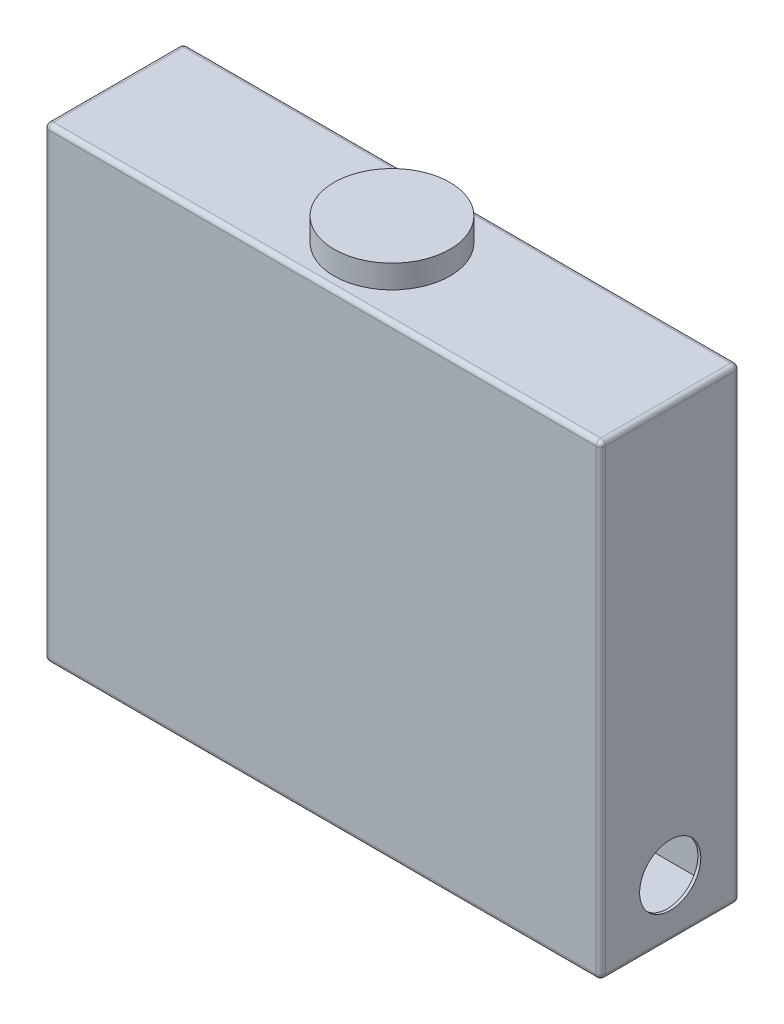
ISO-10303-21;
HEADER;
FILE_DESCRIPTION(('STEP AP214'),'2;1');
FILE_NAME('part.step','',(''),(''),'','','');
FILE_SCHEMA(('AUTOMOTIVE_DESIGN { 1 0 10303 214 1 1 1 1 }'));
ENDSEC;
DATA;
#1=APPLICATION_CONTEXT('core data for automotive mechanical design processes');
#2=APPLICATION_PROTOCOL_DEFINITION('international standard','automotive_design',2000,#1);
#3=PRODUCT_CONTEXT('',#1,'mechanical');
#4=PRODUCT('Part','Part','',(#3));
#5=PRODUCT_RELATED_PRODUCT_CATEGORY('part','',(#4));
#6=PRODUCT_DEFINITION_FORMATION('','',#4);
#7=PRODUCT_DEFINITION_CONTEXT('part definition',#1,'design');
#8=PRODUCT_DEFINITION('design','',#6,#7);
#9=PRODUCT_DEFINITION_SHAPE('','',#8);
#10=(LENGTH_UNIT() NAMED_UNIT(*) SI_UNIT(.MILLI.,.METRE.));
#11=(NAMED_UNIT(*) PLANE_ANGLE_UNIT() SI_UNIT($,.RADIAN.));
#12=(NAMED_UNIT(*) SI_UNIT($,.STERADIAN.) SOLID_ANGLE_UNIT());
#13=UNCERTAINTY_MEASURE_WITH_UNIT(LENGTH_MEASURE(1.E-05),#10,'distance_accuracy_value','');
#14=(GEOMETRIC_REPRESENTATION_CONTEXT(3) GLOBAL_UNCERTAINTY_ASSIGNED_CONTEXT((#13)) GLOBAL_UNIT_ASSIGNED_CONTEXT((#10,
#11,#12)) REPRESENTATION_CONTEXT('',''));
#15=CARTESIAN_POINT('',(0.,0.,0.));
#16=DIRECTION('',(0.,0.,1.));
#17=DIRECTION('',(1.,0.,0.));
#18=AXIS2_PLACEMENT_3D('',#15,#16,#17);
#19=CARTESIAN_POINT('',(152.4,268.2875,-38.1));
#20=DIRECTION('',(0.,-1.,0.));
#21=DIRECTION('',(0.,0.,-1.));
#22=AXIS2_PLACEMENT_3D('',#19,#20,#21);
#23=CYLINDRICAL_SURFACE('',#22,31.75);
#24=CARTESIAN_POINT('',(152.4,268.2875,-38.1));
#25=DIRECTION('',(0.,1.,0.));
#26=DIRECTION('',(0.,0.,1.));
#27=AXIS2_PLACEMENT_3D('',#24,#25,#26);
#28=CIRCLE('',#27,31.75);
#29=CARTESIAN_POINT('',(152.4,268.2875,-6.35000000000001));
#30=VERTEX_POINT('',#29);
#31=EDGE_CURVE('E11',#30,#30,#28,.T.);
#32=ORIENTED_EDGE('',*,*,#31,.F.);
#33=EDGE_LOOP('',(#32));
#34=FACE_BOUND('',#33,.T.);
#35=CARTESIAN_POINT('',(152.4,255.5875,-38.1));
#36=DIRECTION('',(0.,1.,0.));
#37=DIRECTION('',(0.,0.,1.));
#38=AXIS2_PLACEMENT_3D('',#35,#36,#37);
#39=CIRCLE('',#38,31.75);
#40=CARTESIAN_POINT('',(152.4,255.5875,-6.35000000000001));
#41=VERTEX_POINT('',#40);
#42=EDGE_CURVE('E50',#41,#41,#39,.T.);
#43=ORIENTED_EDGE('',*,*,#42,.T.);
#44=EDGE_LOOP('',(#43));
#45=FACE_BOUND('',#44,.T.);
#46=ADVANCED_FACE('F47',(#34,#45),#23,.T.);
#47=CARTESIAN_POINT('',(152.4,268.2875,-38.1));
#48=DIRECTION('',(0.,1.,0.));
#49=DIRECTION('',(0.,0.,1.));
#50=AXIS2_PLACEMENT_3D('',#47,#48,#49);
#51=PLANE('',#50);
#52=ORIENTED_EDGE('',*,*,#31,.T.);
#53=EDGE_LOOP('',(#52));
#54=FACE_BOUND('',#53,.T.);
#55=ADVANCED_FACE('F62',(#54),#51,.T.);
#56=CARTESIAN_POINT('',(152.4,255.5875,-38.1));
#57=DIRECTION('',(0.,1.,0.));
#58=DIRECTION('',(0.,0.,1.));
#59=AXIS2_PLACEMENT_3D('',#56,#57,#58);
#60=PLANE('',#59);
#61=ORIENTED_EDGE('',*,*,#42,.F.);
#62=EDGE_LOOP('',(#61));
#63=FACE_BOUND('',#62,.T.);
#64=ADVANCED_FACE('F60',(#63),#60,.F.);
#65=CLOSED_SHELL('',(#46,#55,#64));
#66=MANIFOLD_SOLID_BREP('B2',#65);
#67=CARTESIAN_POINT('',(0.,254.,0.));
#68=DIRECTION('',(1.,0.,0.));
#69=DIRECTION('',(0.,0.,-1.));
#70=AXIS2_PLACEMENT_3D('',#67,#68,#69);
#71=PLANE('',#70);
#72=DIRECTION('',(0.,-1.,0.));
#73=VECTOR('',#72,1.);
#74=CARTESIAN_POINT('',(0.,254.,-73.66));
#75=LINE('',#74,#73);
#76=CARTESIAN_POINT('',(0.,253.0475,-73.66));
#77=VERTEX_POINT('',#76);
#78=CARTESIAN_POINT('',(0.,2.53999999999999,-73.66));
#79=VERTEX_POINT('',#78);
#80=EDGE_CURVE('E260',#77,#79,#75,.T.);
#81=ORIENTED_EDGE('',*,*,#80,.T.);
#82=DIRECTION('',(0.,0.,1.));
#83=VECTOR('',#82,1.);
#84=CARTESIAN_POINT('',(0.,2.53999999999999,0.));
#85=LINE('',#84,#83);
#86=CARTESIAN_POINT('',(0.,2.53999999999999,-2.54));
#87=VERTEX_POINT('',#86);
#88=EDGE_CURVE('E263',#79,#87,#85,.T.);
#89=ORIENTED_EDGE('',*,*,#88,.T.);
#90=DIRECTION('',(0.,-1.,0.));
#91=VECTOR('',#90,1.);
#92=CARTESIAN_POINT('',(0.,254.,-2.54));
#93=LINE('',#92,#91);
#94=CARTESIAN_POINT('',(0.,253.0475,-2.54));
#95=VERTEX_POINT('',#94);
#96=EDGE_CURVE('E228',#87,#95,#93,.F.);
#97=ORIENTED_EDGE('',*,*,#96,.T.);
#98=DIRECTION('',(0.,0.,1.));
#99=VECTOR('',#98,1.);
#100=CARTESIAN_POINT('',(0.,253.0475,-76.2));
#101=LINE('',#100,#99);
#102=EDGE_CURVE('E233',#95,#77,#101,.F.);
#103=ORIENTED_EDGE('',*,*,#102,.T.);
#104=EDGE_LOOP('',(#81,#89,#97,#103));
#105=FACE_BOUND('',#104,.T.);
#106=ADVANCED_FACE('F87',(#105),#71,.F.);
#107=CARTESIAN_POINT('',(0.,254.,0.));
#108=DIRECTION('',(0.,0.,-1.));
#109=DIRECTION('',(-1.,0.,0.));
#110=AXIS2_PLACEMENT_3D('',#107,#108,#109);
#111=PLANE('',#110);
#112=DIRECTION('',(1.,0.,0.));
#113=VECTOR('',#112,1.);
#114=CARTESIAN_POINT('',(0.,253.0475,0.));
#115=LINE('',#114,#113);
#116=CARTESIAN_POINT('',(302.26,253.0475,0.));
#117=VERTEX_POINT('',#116);
#118=CARTESIAN_POINT('',(2.54,253.0475,0.));
#119=VERTEX_POINT('',#118);
#120=EDGE_CURVE('E97',#117,#119,#115,.F.);
#121=ORIENTED_EDGE('',*,*,#120,.T.);
#122=DIRECTION('',(0.,-1.,0.));
#123=VECTOR('',#122,1.);
#124=CARTESIAN_POINT('',(2.54,254.,0.));
#125=LINE('',#124,#123);
#126=CARTESIAN_POINT('',(2.54,2.53999999999999,0.));
#127=VERTEX_POINT('',#126);
#128=EDGE_CURVE('E45',#119,#127,#125,.T.);
#129=ORIENTED_EDGE('',*,*,#128,.T.);
#130=DIRECTION('',(1.,0.,0.));
#131=VECTOR('',#130,1.);
#132=CARTESIAN_POINT('',(304.8,2.53999999999999,0.));
#133=LINE('',#132,#131);
#134=CARTESIAN_POINT('',(302.26,2.53999999999999,0.));
#135=VERTEX_POINT('',#134);
#136=EDGE_CURVE('E319',#127,#135,#133,.T.);
#137=ORIENTED_EDGE('',*,*,#136,.T.);
#138=DIRECTION('',(0.,-1.,0.));
#139=VECTOR('',#138,1.);
#140=CARTESIAN_POINT('',(302.26,254.,0.));
#141=LINE('',#140,#139);
#142=EDGE_CURVE('E108',#135,#117,#141,.F.);
#143=ORIENTED_EDGE('',*,*,#142,.T.);
#144=EDGE_LOOP('',(#121,#129,#137,#143));
#145=FACE_BOUND('',#144,.T.);
#146=ADVANCED_FACE('F444',(#145),#111,.F.);
#147=CARTESIAN_POINT('',(304.8,254.,0.));
#148=DIRECTION('',(-1.,0.,0.));
#149=DIRECTION('',(0.,0.,1.));
#150=AXIS2_PLACEMENT_3D('',#147,#148,#149);
#151=PLANE('',#150);
#152=CARTESIAN_POINT('',(304.8,31.75,-38.1));
#153=DIRECTION('',(1.,0.,0.));
#154=DIRECTION('',(0.,0.,-1.));
#155=AXIS2_PLACEMENT_3D('',#152,#153,#154);
#156=CIRCLE('',#155,16.764);
#157=CARTESIAN_POINT('',(304.8,31.75,-54.864));
#158=VERTEX_POINT('',#157);
#159=EDGE_CURVE('E330',#158,#158,#156,.T.);
#160=ORIENTED_EDGE('',*,*,#159,.F.);
#161=EDGE_LOOP('',(#160));
#162=FACE_BOUND('',#161,.T.);
#163=DIRECTION('',(0.,0.,-1.));
#164=VECTOR('',#163,1.);
#165=CARTESIAN_POINT('',(304.8,2.53999999999999,-76.2));
#166=LINE('',#165,#164);
#167=CARTESIAN_POINT('',(304.8,2.53999999999999,-2.54));
#168=VERTEX_POINT('',#167);
#169=CARTESIAN_POINT('',(304.8,2.53999999999999,-73.66));
#170=VERTEX_POINT('',#169);
#171=EDGE_CURVE('E299',#168,#170,#166,.T.);
#172=ORIENTED_EDGE('',*,*,#171,.T.);
#173=DIRECTION('',(0.,-1.,0.));
#174=VECTOR('',#173,1.);
#175=CARTESIAN_POINT('',(304.8,254.,-73.66));
#176=LINE('',#175,#174);
#177=CARTESIAN_POINT('',(304.8,253.0475,-73.66));
#178=VERTEX_POINT('',#177);
#179=EDGE_CURVE('E302',#170,#178,#176,.F.);
#180=ORIENTED_EDGE('',*,*,#179,.T.);
#181=DIRECTION('',(0.,0.,-1.));
#182=VECTOR('',#181,1.);
#183=CARTESIAN_POINT('',(304.8,253.0475,0.));
#184=LINE('',#183,#182);
#185=CARTESIAN_POINT('',(304.8,253.0475,-2.54));
#186=VERTEX_POINT('',#185);
#187=EDGE_CURVE('E296',#178,#186,#184,.F.);
#188=ORIENTED_EDGE('',*,*,#187,.T.);
#189=DIRECTION('',(0.,-1.,0.));
#190=VECTOR('',#189,1.);
#191=CARTESIAN_POINT('',(304.8,254.,-2.54));
#192=LINE('',#191,#190);
#193=EDGE_CURVE('E293',#186,#168,#192,.T.);
#194=ORIENTED_EDGE('',*,*,#193,.T.);
#195=EDGE_LOOP('',(#172,#180,#188,#194));
#196=FACE_BOUND('',#195,.T.);
#197=ADVANCED_FACE('F450',(#162,#196),#151,.F.);
#198=CARTESIAN_POINT('',(0.,254.,-76.2));
#199=DIRECTION('',(0.,0.,1.));
#200=DIRECTION('',(1.,0.,0.));
#201=AXIS2_PLACEMENT_3D('',#198,#199,#200);
#202=PLANE('',#201);
#203=DIRECTION('',(-1.,0.,0.));
#204=VECTOR('',#203,1.);
#205=CARTESIAN_POINT('',(0.,2.53999999999999,-76.2));
#206=LINE('',#205,#204);
#207=CARTESIAN_POINT('',(302.26,2.53999999999999,-76.2));
#208=VERTEX_POINT('',#207);
#209=CARTESIAN_POINT('',(2.54,2.53999999999999,-76.2));
#210=VERTEX_POINT('',#209);
#211=EDGE_CURVE('E286',#208,#210,#206,.T.);
#212=ORIENTED_EDGE('',*,*,#211,.T.);
#213=DIRECTION('',(0.,-1.,0.));
#214=VECTOR('',#213,1.);
#215=CARTESIAN_POINT('',(2.54,254.,-76.2));
#216=LINE('',#215,#214);
#217=CARTESIAN_POINT('',(2.54,253.0475,-76.2));
#218=VERTEX_POINT('',#217);
#219=EDGE_CURVE('E289',#210,#218,#216,.F.);
#220=ORIENTED_EDGE('',*,*,#219,.T.);
#221=DIRECTION('',(-1.,0.,0.));
#222=VECTOR('',#221,1.);
#223=CARTESIAN_POINT('',(304.8,253.0475,-76.2));
#224=LINE('',#223,#222);
#225=CARTESIAN_POINT('',(302.26,253.0475,-76.2));
#226=VERTEX_POINT('',#225);
#227=EDGE_CURVE('E280',#218,#226,#224,.F.);
#228=ORIENTED_EDGE('',*,*,#227,.T.);
#229=DIRECTION('',(0.,-1.,0.));
#230=VECTOR('',#229,1.);
#231=CARTESIAN_POINT('',(302.26,254.,-76.2));
#232=LINE('',#231,#230);
#233=EDGE_CURVE('E283',#226,#208,#232,.T.);
#234=ORIENTED_EDGE('',*,*,#233,.T.);
#235=EDGE_LOOP('',(#212,#220,#228,#234));
#236=FACE_BOUND('',#235,.T.);
#237=ADVANCED_FACE('F554',(#236),#202,.F.);
#238=CARTESIAN_POINT('',(0.,0.,0.));
#239=DIRECTION('',(0.,-1.,0.));
#240=DIRECTION('',(0.,0.,-1.));
#241=AXIS2_PLACEMENT_3D('',#238,#239,#240);
#242=PLANE('',#241);
#243=DIRECTION('',(1.,0.,0.));
#244=VECTOR('',#243,1.);
#245=CARTESIAN_POINT('',(0.,0.,-2.54));
#246=LINE('',#245,#244);
#247=CARTESIAN_POINT('',(302.26,0.,-2.54));
#248=VERTEX_POINT('',#247);
#249=CARTESIAN_POINT('',(2.54,0.,-2.54));
#250=VERTEX_POINT('',#249);
#251=EDGE_CURVE('E267',#248,#250,#246,.F.);
#252=ORIENTED_EDGE('',*,*,#251,.T.);
#253=DIRECTION('',(0.,0.,1.));
#254=VECTOR('',#253,1.);
#255=CARTESIAN_POINT('',(2.54,0.,-76.2));
#256=LINE('',#255,#254);
#257=CARTESIAN_POINT('',(2.54,0.,-73.66));
#258=VERTEX_POINT('',#257);
#259=EDGE_CURVE('E276',#250,#258,#256,.F.);
#260=ORIENTED_EDGE('',*,*,#259,.T.);
#261=DIRECTION('',(-1.,0.,0.));
#262=VECTOR('',#261,1.);
#263=CARTESIAN_POINT('',(304.8,0.,-73.66));
#264=LINE('',#263,#262);
#265=CARTESIAN_POINT('',(302.26,0.,-73.66));
#266=VERTEX_POINT('',#265);
#267=EDGE_CURVE('E273',#258,#266,#264,.F.);
#268=ORIENTED_EDGE('',*,*,#267,.T.);
#269=DIRECTION('',(0.,0.,-1.));
#270=VECTOR('',#269,1.);
#271=CARTESIAN_POINT('',(302.26,0.,0.));
#272=LINE('',#271,#270);
#273=EDGE_CURVE('E270',#266,#248,#272,.F.);
#274=ORIENTED_EDGE('',*,*,#273,.T.);
#275=EDGE_LOOP('',(#252,#260,#268,#274));
#276=FACE_BOUND('',#275,.T.);
#277=ADVANCED_FACE('F571',(#276),#242,.T.);
#278=CARTESIAN_POINT('',(0.,255.5875,0.));
#279=DIRECTION('',(0.,1.,0.));
#280=DIRECTION('',(0.,0.,1.));
#281=AXIS2_PLACEMENT_3D('',#278,#279,#280);
#282=PLANE('',#281);
#283=CARTESIAN_POINT('',(152.4,255.5875,-38.1));
#284=DIRECTION('',(0.,1.,0.));
#285=DIRECTION('',(0.,0.,1.));
#286=AXIS2_PLACEMENT_3D('',#283,#284,#285);
#287=CIRCLE('',#286,28.575);
#288=CARTESIAN_POINT('',(152.4,255.5875,-9.52500000000004));
#289=VERTEX_POINT('',#288);
#290=EDGE_CURVE('E597',#289,#289,#287,.T.);
#291=ORIENTED_EDGE('',*,*,#290,.F.);
#292=EDGE_LOOP('',(#291));
#293=FACE_BOUND('',#292,.T.);
#294=DIRECTION('',(0.,0.,-1.));
#295=VECTOR('',#294,1.);
#296=CARTESIAN_POINT('',(302.26,255.5875,-76.2));
#297=LINE('',#296,#295);
#298=CARTESIAN_POINT('',(302.26,255.5875,-2.54));
#299=VERTEX_POINT('',#298);
#300=CARTESIAN_POINT('',(302.26,255.5875,-73.66));
#301=VERTEX_POINT('',#300);
#302=EDGE_CURVE('E312',#299,#301,#297,.T.);
#303=ORIENTED_EDGE('',*,*,#302,.T.);
#304=DIRECTION('',(-1.,0.,0.));
#305=VECTOR('',#304,1.);
#306=CARTESIAN_POINT('',(0.,255.5875,-73.66));
#307=LINE('',#306,#305);
#308=CARTESIAN_POINT('',(2.54,255.5875,-73.66));
#309=VERTEX_POINT('',#308);
#310=EDGE_CURVE('E315',#301,#309,#307,.T.);
#311=ORIENTED_EDGE('',*,*,#310,.T.);
#312=DIRECTION('',(0.,0.,1.));
#313=VECTOR('',#312,1.);
#314=CARTESIAN_POINT('',(2.54,255.5875,0.));
#315=LINE('',#314,#313);
#316=CARTESIAN_POINT('',(2.54,255.5875,-2.54));
#317=VERTEX_POINT('',#316);
#318=EDGE_CURVE('E309',#309,#317,#315,.T.);
#319=ORIENTED_EDGE('',*,*,#318,.T.);
#320=DIRECTION('',(1.,0.,0.));
#321=VECTOR('',#320,1.);
#322=CARTESIAN_POINT('',(304.8,255.5875,-2.54));
#323=LINE('',#322,#321);
#324=EDGE_CURVE('E306',#317,#299,#323,.T.);
#325=ORIENTED_EDGE('',*,*,#324,.T.);
#326=EDGE_LOOP('',(#303,#311,#319,#325));
#327=FACE_BOUND('',#326,.T.);
#328=ADVANCED_FACE('F530',(#293,#327),#282,.T.);
#329=CARTESIAN_POINT('',(302.26,253.0475,0.));
#330=DIRECTION('',(0.,0.,1.));
#331=DIRECTION('',(1.,0.,0.));
#332=AXIS2_PLACEMENT_3D('',#329,#330,#331);
#333=CYLINDRICAL_SURFACE('',#332,2.54);
#334=CARTESIAN_POINT('',(302.26,253.0475,-73.66));
#335=DIRECTION('',(0.,0.,-1.));
#336=DIRECTION('',(-1.,0.,0.));
#337=AXIS2_PLACEMENT_3D('',#334,#335,#336);
#338=CIRCLE('',#337,2.54);
#339=EDGE_CURVE('E91',#301,#178,#338,.T.);
#340=ORIENTED_EDGE('',*,*,#339,.F.);
#341=ORIENTED_EDGE('',*,*,#302,.F.);
#342=CARTESIAN_POINT('',(302.26,253.0475,-2.54));
#343=DIRECTION('',(0.,0.,1.));
#344=DIRECTION('',(1.,0.,0.));
#345=AXIS2_PLACEMENT_3D('',#342,#343,#344);
#346=CIRCLE('',#345,2.54);
#347=EDGE_CURVE('E407',#186,#299,#346,.T.);
#348=ORIENTED_EDGE('',*,*,#347,.F.);
#349=ORIENTED_EDGE('',*,*,#187,.F.);
#350=EDGE_LOOP('',(#340,#341,#348,#349));
#351=FACE_BOUND('',#350,.T.);
#352=ADVANCED_FACE('F89',(#351),#333,.T.);
#353=CARTESIAN_POINT('',(302.26,253.0475,-73.66));
#354=DIRECTION('',(0.,0.,1.));
#355=DIRECTION('',(1.,0.,0.));
#356=AXIS2_PLACEMENT_3D('',#353,#354,#355);
#357=SPHERICAL_SURFACE('',#356,2.54);
#358=CARTESIAN_POINT('',(302.26,253.0475,-73.66));
#359=DIRECTION('',(1.,0.,0.));
#360=DIRECTION('',(0.,0.,-1.));
#361=AXIS2_PLACEMENT_3D('',#358,#359,#360);
#362=CIRCLE('',#361,2.54);
#363=EDGE_CURVE('E401',#301,#226,#362,.F.);
#364=ORIENTED_EDGE('',*,*,#363,.F.);
#365=ORIENTED_EDGE('',*,*,#339,.T.);
#366=CARTESIAN_POINT('',(302.26,253.0475,-73.66));
#367=DIRECTION('',(0.,1.,0.));
#368=DIRECTION('',(0.,0.,1.));
#369=AXIS2_PLACEMENT_3D('',#366,#367,#368);
#370=CIRCLE('',#369,2.54);
#371=EDGE_CURVE('E405',#226,#178,#370,.F.);
#372=ORIENTED_EDGE('',*,*,#371,.F.);
#373=EDGE_LOOP('',(#364,#365,#372));
#374=FACE_BOUND('',#373,.T.);
#375=ADVANCED_FACE('F525',(#374),#357,.T.);
#376=CARTESIAN_POINT('',(302.26,253.0475,-2.54));
#377=DIRECTION('',(0.,0.,1.));
#378=DIRECTION('',(1.,0.,0.));
#379=AXIS2_PLACEMENT_3D('',#376,#377,#378);
#380=SPHERICAL_SURFACE('',#379,2.54);
#381=CARTESIAN_POINT('',(302.26,253.0475,-2.54));
#382=DIRECTION('',(0.,1.,0.));
#383=DIRECTION('',(0.,0.,1.));
#384=AXIS2_PLACEMENT_3D('',#381,#382,#383);
#385=CIRCLE('',#384,2.54);
#386=EDGE_CURVE('E394',#186,#117,#385,.F.);
#387=ORIENTED_EDGE('',*,*,#386,.F.);
#388=ORIENTED_EDGE('',*,*,#347,.T.);
#389=CARTESIAN_POINT('',(302.26,253.0475,-2.54));
#390=DIRECTION('',(1.,0.,0.));
#391=DIRECTION('',(0.,0.,-1.));
#392=AXIS2_PLACEMENT_3D('',#389,#390,#391);
#393=CIRCLE('',#392,2.54);
#394=EDGE_CURVE('E397',#117,#299,#393,.F.);
#395=ORIENTED_EDGE('',*,*,#394,.F.);
#396=EDGE_LOOP('',(#387,#388,#395));
#397=FACE_BOUND('',#396,.T.);
#398=ADVANCED_FACE('F522',(#397),#380,.T.);
#399=CARTESIAN_POINT('',(302.26,254.,-73.66));
#400=DIRECTION('',(0.,-1.,0.));
#401=DIRECTION('',(0.,0.,-1.));
#402=AXIS2_PLACEMENT_3D('',#399,#400,#401);
#403=CYLINDRICAL_SURFACE('',#402,2.54);
#404=ORIENTED_EDGE('',*,*,#371,.T.);
#405=ORIENTED_EDGE('',*,*,#179,.F.);
#406=CARTESIAN_POINT('',(302.26,2.53999999999999,-73.66));
#407=DIRECTION('',(0.,-1.,0.));
#408=DIRECTION('',(0.,0.,-1.));
#409=AXIS2_PLACEMENT_3D('',#406,#407,#408);
#410=CIRCLE('',#409,2.54);
#411=EDGE_CURVE('E386',#208,#170,#410,.T.);
#412=ORIENTED_EDGE('',*,*,#411,.F.);
#413=ORIENTED_EDGE('',*,*,#233,.F.);
#414=EDGE_LOOP('',(#404,#405,#412,#413));
#415=FACE_BOUND('',#414,.T.);
#416=ADVANCED_FACE('F518',(#415),#403,.T.);
#417=CARTESIAN_POINT('',(0.,253.0475,-73.66));
#418=DIRECTION('',(1.,0.,0.));
#419=DIRECTION('',(0.,0.,-1.));
#420=AXIS2_PLACEMENT_3D('',#417,#418,#419);
#421=CYLINDRICAL_SURFACE('',#420,2.54);
#422=ORIENTED_EDGE('',*,*,#363,.T.);
#423=ORIENTED_EDGE('',*,*,#227,.F.);
#424=CARTESIAN_POINT('',(2.54,253.0475,-73.66));
#425=DIRECTION('',(-1.,0.,0.));
#426=DIRECTION('',(0.,0.,1.));
#427=AXIS2_PLACEMENT_3D('',#424,#425,#426);
#428=CIRCLE('',#427,2.54);
#429=EDGE_CURVE('E382',#309,#218,#428,.T.);
#430=ORIENTED_EDGE('',*,*,#429,.F.);
#431=ORIENTED_EDGE('',*,*,#310,.F.);
#432=EDGE_LOOP('',(#422,#423,#430,#431));
#433=FACE_BOUND('',#432,.T.);
#434=ADVANCED_FACE('F514',(#433),#421,.T.);
#435=CARTESIAN_POINT('',(2.54,253.0475,0.));
#436=DIRECTION('',(0.,0.,-1.));
#437=DIRECTION('',(-1.,0.,0.));
#438=AXIS2_PLACEMENT_3D('',#435,#436,#437);
#439=CYLINDRICAL_SURFACE('',#438,2.54);
#440=CARTESIAN_POINT('',(2.54,253.0475,-2.54));
#441=DIRECTION('',(0.,0.,1.));
#442=DIRECTION('',(1.,0.,0.));
#443=AXIS2_PLACEMENT_3D('',#440,#441,#442);
#444=CIRCLE('',#443,2.54);
#445=EDGE_CURVE('E375',#317,#95,#444,.T.);
#446=ORIENTED_EDGE('',*,*,#445,.F.);
#447=ORIENTED_EDGE('',*,*,#318,.F.);
#448=CARTESIAN_POINT('',(2.54,253.0475,-73.66));
#449=DIRECTION('',(0.,0.,-1.));
#450=DIRECTION('',(-1.,0.,0.));
#451=AXIS2_PLACEMENT_3D('',#448,#449,#450);
#452=CIRCLE('',#451,2.54);
#453=EDGE_CURVE('E379',#77,#309,#452,.T.);
#454=ORIENTED_EDGE('',*,*,#453,.F.);
#455=ORIENTED_EDGE('',*,*,#102,.F.);
#456=EDGE_LOOP('',(#446,#447,#454,#455));
#457=FACE_BOUND('',#456,.T.);
#458=ADVANCED_FACE('F510',(#457),#439,.T.);
#459=CARTESIAN_POINT('',(0.,253.0475,-2.54));
#460=DIRECTION('',(-1.,0.,0.));
#461=DIRECTION('',(0.,0.,1.));
#462=AXIS2_PLACEMENT_3D('',#459,#460,#461);
#463=CYLINDRICAL_SURFACE('',#462,2.54);
#464=ORIENTED_EDGE('',*,*,#394,.T.);
#465=ORIENTED_EDGE('',*,*,#324,.F.);
#466=CARTESIAN_POINT('',(2.54,253.0475,-2.54));
#467=DIRECTION('',(-1.,0.,0.));
#468=DIRECTION('',(0.,0.,1.));
#469=AXIS2_PLACEMENT_3D('',#466,#467,#468);
#470=CIRCLE('',#469,2.54);
#471=EDGE_CURVE('E371',#119,#317,#470,.T.);
#472=ORIENTED_EDGE('',*,*,#471,.F.);
#473=ORIENTED_EDGE('',*,*,#120,.F.);
#474=EDGE_LOOP('',(#464,#465,#472,#473));
#475=FACE_BOUND('',#474,.T.);
#476=ADVANCED_FACE('F506',(#475),#463,.T.);
#477=CARTESIAN_POINT('',(302.26,254.,-2.54));
#478=DIRECTION('',(0.,-1.,0.));
#479=DIRECTION('',(0.,0.,-1.));
#480=AXIS2_PLACEMENT_3D('',#477,#478,#479);
#481=CYLINDRICAL_SURFACE('',#480,2.54);
#482=ORIENTED_EDGE('',*,*,#386,.T.);
#483=ORIENTED_EDGE('',*,*,#142,.F.);
#484=CARTESIAN_POINT('',(302.26,2.53999999999999,-2.54));
#485=DIRECTION('',(0.,-1.,0.));
#486=DIRECTION('',(0.,0.,-1.));
#487=AXIS2_PLACEMENT_3D('',#484,#485,#486);
#488=CIRCLE('',#487,2.54);
#489=EDGE_CURVE('E367',#168,#135,#488,.T.);
#490=ORIENTED_EDGE('',*,*,#489,.F.);
#491=ORIENTED_EDGE('',*,*,#193,.F.);
#492=EDGE_LOOP('',(#482,#483,#490,#491));
#493=FACE_BOUND('',#492,.T.);
#494=ADVANCED_FACE('F502',(#493),#481,.T.);
#495=CARTESIAN_POINT('',(302.26,2.53999999999999,0.));
#496=DIRECTION('',(0.,0.,1.));
#497=DIRECTION('',(1.,0.,0.));
#498=AXIS2_PLACEMENT_3D('',#495,#496,#497);
#499=CYLINDRICAL_SURFACE('',#498,2.54);
#500=CARTESIAN_POINT('',(302.26,2.53999999999999,-73.66));
#501=DIRECTION('',(0.,0.,-1.));
#502=DIRECTION('',(-1.,0.,0.));
#503=AXIS2_PLACEMENT_3D('',#500,#501,#502);
#504=CIRCLE('',#503,2.54);
#505=EDGE_CURVE('E390',#170,#266,#504,.T.);
#506=ORIENTED_EDGE('',*,*,#505,.F.);
#507=ORIENTED_EDGE('',*,*,#171,.F.);
#508=CARTESIAN_POINT('',(302.26,2.54,-2.54));
#509=DIRECTION('',(0.,0.,1.));
#510=DIRECTION('',(1.,0.,0.));
#511=AXIS2_PLACEMENT_3D('',#508,#509,#510);
#512=CIRCLE('',#511,2.54);
#513=EDGE_CURVE('E363',#248,#168,#512,.T.);
#514=ORIENTED_EDGE('',*,*,#513,.F.);
#515=ORIENTED_EDGE('',*,*,#273,.F.);
#516=EDGE_LOOP('',(#506,#507,#514,#515));
#517=FACE_BOUND('',#516,.T.);
#518=ADVANCED_FACE('F498',(#517),#499,.T.);
#519=CARTESIAN_POINT('',(302.26,2.54,-73.66));
#520=DIRECTION('',(0.,0.,1.));
#521=DIRECTION('',(1.,0.,0.));
#522=AXIS2_PLACEMENT_3D('',#519,#520,#521);
#523=SPHERICAL_SURFACE('',#522,2.54);
#524=ORIENTED_EDGE('',*,*,#411,.T.);
#525=ORIENTED_EDGE('',*,*,#505,.T.);
#526=CARTESIAN_POINT('',(302.26,2.54,-73.66));
#527=DIRECTION('',(1.,0.,0.));
#528=DIRECTION('',(0.,0.,-1.));
#529=AXIS2_PLACEMENT_3D('',#526,#527,#528);
#530=CIRCLE('',#529,2.54);
#531=EDGE_CURVE('E359',#208,#266,#530,.F.);
#532=ORIENTED_EDGE('',*,*,#531,.F.);
#533=EDGE_LOOP('',(#524,#525,#532));
#534=FACE_BOUND('',#533,.T.);
#535=ADVANCED_FACE('F494',(#534),#523,.T.);
#536=CARTESIAN_POINT('',(2.54,253.0475,-73.66));
#537=DIRECTION('',(0.,0.,1.));
#538=DIRECTION('',(1.,0.,0.));
#539=AXIS2_PLACEMENT_3D('',#536,#537,#538);
#540=SPHERICAL_SURFACE('',#539,2.54);
#541=ORIENTED_EDGE('',*,*,#453,.T.);
#542=ORIENTED_EDGE('',*,*,#429,.T.);
#543=CARTESIAN_POINT('',(2.54,253.0475,-73.66));
#544=DIRECTION('',(0.,1.,0.));
#545=DIRECTION('',(0.,0.,1.));
#546=AXIS2_PLACEMENT_3D('',#543,#544,#545);
#547=CIRCLE('',#546,2.54);
#548=EDGE_CURVE('E356',#77,#218,#547,.F.);
#549=ORIENTED_EDGE('',*,*,#548,.F.);
#550=EDGE_LOOP('',(#541,#542,#549));
#551=FACE_BOUND('',#550,.T.);
#552=ADVANCED_FACE('F490',(#551),#540,.T.);
#553=CARTESIAN_POINT('',(2.54,253.0475,-2.54));
#554=DIRECTION('',(0.,0.,1.));
#555=DIRECTION('',(1.,0.,0.));
#556=AXIS2_PLACEMENT_3D('',#553,#554,#555);
#557=SPHERICAL_SURFACE('',#556,2.54);
#558=ORIENTED_EDGE('',*,*,#471,.T.);
#559=ORIENTED_EDGE('',*,*,#445,.T.);
#560=CARTESIAN_POINT('',(2.54,253.0475,-2.54));
#561=DIRECTION('',(0.,1.,0.));
#562=DIRECTION('',(0.,0.,1.));
#563=AXIS2_PLACEMENT_3D('',#560,#561,#562);
#564=CIRCLE('',#563,2.54);
#565=EDGE_CURVE('E352',#119,#95,#564,.F.);
#566=ORIENTED_EDGE('',*,*,#565,.F.);
#567=EDGE_LOOP('',(#558,#559,#566));
#568=FACE_BOUND('',#567,.T.);
#569=ADVANCED_FACE('F486',(#568),#557,.T.);
#570=CARTESIAN_POINT('',(302.26,2.54,-2.54));
#571=DIRECTION('',(0.,0.,1.));
#572=DIRECTION('',(1.,0.,0.));
#573=AXIS2_PLACEMENT_3D('',#570,#571,#572);
#574=SPHERICAL_SURFACE('',#573,2.54);
#575=ORIENTED_EDGE('',*,*,#513,.T.);
#576=ORIENTED_EDGE('',*,*,#489,.T.);
#577=CARTESIAN_POINT('',(302.26,2.53999999999999,-2.54));
#578=DIRECTION('',(1.,0.,0.));
#579=DIRECTION('',(0.,0.,-1.));
#580=AXIS2_PLACEMENT_3D('',#577,#578,#579);
#581=CIRCLE('',#580,2.54);
#582=EDGE_CURVE('E348',#248,#135,#581,.F.);
#583=ORIENTED_EDGE('',*,*,#582,.F.);
#584=EDGE_LOOP('',(#575,#576,#583));
#585=FACE_BOUND('',#584,.T.);
#586=ADVANCED_FACE('F482',(#585),#574,.T.);
#587=CARTESIAN_POINT('',(0.,2.53999999999999,-73.66));
#588=DIRECTION('',(1.,0.,0.));
#589=DIRECTION('',(0.,0.,-1.));
#590=AXIS2_PLACEMENT_3D('',#587,#588,#589);
#591=CYLINDRICAL_SURFACE('',#590,2.54);
#592=ORIENTED_EDGE('',*,*,#531,.T.);
#593=ORIENTED_EDGE('',*,*,#267,.F.);
#594=CARTESIAN_POINT('',(2.54,2.53999999999999,-73.66));
#595=DIRECTION('',(-1.,0.,0.));
#596=DIRECTION('',(0.,0.,1.));
#597=AXIS2_PLACEMENT_3D('',#594,#595,#596);
#598=CIRCLE('',#597,2.54);
#599=EDGE_CURVE('E344',#210,#258,#598,.T.);
#600=ORIENTED_EDGE('',*,*,#599,.F.);
#601=ORIENTED_EDGE('',*,*,#211,.F.);
#602=EDGE_LOOP('',(#592,#593,#600,#601));
#603=FACE_BOUND('',#602,.T.);
#604=ADVANCED_FACE('F478',(#603),#591,.T.);
#605=CARTESIAN_POINT('',(2.54,254.,-73.66));
#606=DIRECTION('',(0.,-1.,0.));
#607=DIRECTION('',(0.,0.,-1.));
#608=AXIS2_PLACEMENT_3D('',#605,#606,#607);
#609=CYLINDRICAL_SURFACE('',#608,2.54);
#610=ORIENTED_EDGE('',*,*,#548,.T.);
#611=ORIENTED_EDGE('',*,*,#219,.F.);
#612=CARTESIAN_POINT('',(2.54,2.53999999999999,-73.66));
#613=DIRECTION('',(0.,-1.,0.));
#614=DIRECTION('',(0.,0.,-1.));
#615=AXIS2_PLACEMENT_3D('',#612,#613,#614);
#616=CIRCLE('',#615,2.54);
#617=EDGE_CURVE('E340',#79,#210,#616,.T.);
#618=ORIENTED_EDGE('',*,*,#617,.F.);
#619=ORIENTED_EDGE('',*,*,#80,.F.);
#620=EDGE_LOOP('',(#610,#611,#618,#619));
#621=FACE_BOUND('',#620,.T.);
#622=ADVANCED_FACE('F474',(#621),#609,.T.);
#623=CARTESIAN_POINT('',(2.54,254.,-2.54));
#624=DIRECTION('',(0.,-1.,0.));
#625=DIRECTION('',(0.,0.,-1.));
#626=AXIS2_PLACEMENT_3D('',#623,#624,#625);
#627=CYLINDRICAL_SURFACE('',#626,2.54);
#628=ORIENTED_EDGE('',*,*,#565,.T.);
#629=ORIENTED_EDGE('',*,*,#96,.F.);
#630=CARTESIAN_POINT('',(2.54,2.53999999999999,-2.54));
#631=DIRECTION('',(0.,-1.,0.));
#632=DIRECTION('',(0.,0.,-1.));
#633=AXIS2_PLACEMENT_3D('',#630,#631,#632);
#634=CIRCLE('',#633,2.54);
#635=EDGE_CURVE('E336',#127,#87,#634,.T.);
#636=ORIENTED_EDGE('',*,*,#635,.F.);
#637=ORIENTED_EDGE('',*,*,#128,.F.);
#638=EDGE_LOOP('',(#628,#629,#636,#637));
#639=FACE_BOUND('',#638,.T.);
#640=ADVANCED_FACE('F470',(#639),#627,.T.);
#641=CARTESIAN_POINT('',(0.,2.53999999999999,-2.54));
#642=DIRECTION('',(-1.,0.,0.));
#643=DIRECTION('',(0.,0.,1.));
#644=AXIS2_PLACEMENT_3D('',#641,#642,#643);
#645=CYLINDRICAL_SURFACE('',#644,2.54);
#646=ORIENTED_EDGE('',*,*,#582,.T.);
#647=ORIENTED_EDGE('',*,*,#136,.F.);
#648=CARTESIAN_POINT('',(2.54,2.54,-2.54));
#649=DIRECTION('',(-1.,0.,0.));
#650=DIRECTION('',(0.,0.,1.));
#651=AXIS2_PLACEMENT_3D('',#648,#649,#650);
#652=CIRCLE('',#651,2.54);
#653=EDGE_CURVE('E333',#250,#127,#652,.T.);
#654=ORIENTED_EDGE('',*,*,#653,.F.);
#655=ORIENTED_EDGE('',*,*,#251,.F.);
#656=EDGE_LOOP('',(#646,#647,#654,#655));
#657=FACE_BOUND('',#656,.T.);
#658=ADVANCED_FACE('F466',(#657),#645,.T.);
#659=CARTESIAN_POINT('',(2.54,2.54,-73.66));
#660=DIRECTION('',(0.,0.,1.));
#661=DIRECTION('',(1.,0.,0.));
#662=AXIS2_PLACEMENT_3D('',#659,#660,#661);
#663=SPHERICAL_SURFACE('',#662,2.54);
#664=ORIENTED_EDGE('',*,*,#617,.T.);
#665=ORIENTED_EDGE('',*,*,#599,.T.);
#666=CARTESIAN_POINT('',(2.54,2.54,-73.66));
#667=DIRECTION('',(0.,0.,-1.));
#668=DIRECTION('',(-1.,0.,0.));
#669=AXIS2_PLACEMENT_3D('',#666,#667,#668);
#670=CIRCLE('',#669,2.54);
#671=EDGE_CURVE('E329',#79,#258,#670,.F.);
#672=ORIENTED_EDGE('',*,*,#671,.F.);
#673=EDGE_LOOP('',(#664,#665,#672));
#674=FACE_BOUND('',#673,.T.);
#675=ADVANCED_FACE('F462',(#674),#663,.T.);
#676=CARTESIAN_POINT('',(2.54,2.54,-2.54));
#677=DIRECTION('',(0.,0.,1.));
#678=DIRECTION('',(1.,0.,0.));
#679=AXIS2_PLACEMENT_3D('',#676,#677,#678);
#680=SPHERICAL_SURFACE('',#679,2.54);
#681=ORIENTED_EDGE('',*,*,#653,.T.);
#682=ORIENTED_EDGE('',*,*,#635,.T.);
#683=CARTESIAN_POINT('',(2.54,2.53999999999999,-2.54));
#684=DIRECTION('',(0.,0.,1.));
#685=DIRECTION('',(1.,0.,0.));
#686=AXIS2_PLACEMENT_3D('',#683,#684,#685);
#687=CIRCLE('',#686,2.54);
#688=EDGE_CURVE('E326',#250,#87,#687,.F.);
#689=ORIENTED_EDGE('',*,*,#688,.F.);
#690=EDGE_LOOP('',(#681,#682,#689));
#691=FACE_BOUND('',#690,.T.);
#692=ADVANCED_FACE('F458',(#691),#680,.T.);
#693=CARTESIAN_POINT('',(2.54,2.53999999999999,0.));
#694=DIRECTION('',(0.,0.,-1.));
#695=DIRECTION('',(-1.,0.,0.));
#696=AXIS2_PLACEMENT_3D('',#693,#694,#695);
#697=CYLINDRICAL_SURFACE('',#696,2.54);
#698=ORIENTED_EDGE('',*,*,#671,.T.);
#699=ORIENTED_EDGE('',*,*,#259,.F.);
#700=ORIENTED_EDGE('',*,*,#688,.T.);
#701=ORIENTED_EDGE('',*,*,#88,.F.);
#702=EDGE_LOOP('',(#698,#699,#700,#701));
#703=FACE_BOUND('',#702,.T.);
#704=ADVANCED_FACE('F454',(#703),#697,.T.);
#705=CARTESIAN_POINT('',(-0.000999999999973245,31.75,-38.1));
#706=DIRECTION('',(1.,0.,0.));
#707=DIRECTION('',(0.,0.,-1.));
#708=AXIS2_PLACEMENT_3D('',#705,#706,#707);
#709=CYLINDRICAL_SURFACE('',#708,16.764);
#710=CARTESIAN_POINT('',(303.2125,31.75,-38.1));
#711=DIRECTION('',(-1.,0.,0.));
#712=DIRECTION('',(0.,0.,1.));
#713=AXIS2_PLACEMENT_3D('',#710,#711,#712);
#714=CIRCLE('',#713,16.764);
#715=CARTESIAN_POINT('',(303.2125,31.75,-21.336));
#716=VERTEX_POINT('',#715);
#717=EDGE_CURVE('E595',#716,#716,#714,.F.);
#718=ORIENTED_EDGE('',*,*,#717,.F.);
#719=EDGE_LOOP('',(#718));
#720=FACE_BOUND('',#719,.T.);
#721=ORIENTED_EDGE('',*,*,#159,.T.);
#722=EDGE_LOOP('',(#721));
#723=FACE_BOUND('',#722,.T.);
#724=ADVANCED_FACE('F457',(#720,#723),#709,.F.);
#725=CARTESIAN_POINT('',(0.,1.5875,0.));
#726=DIRECTION('',(0.,-1.,0.));
#727=DIRECTION('',(0.,0.,-1.));
#728=AXIS2_PLACEMENT_3D('',#725,#726,#727);
#729=PLANE('',#728);
#730=DIRECTION('',(0.,0.,1.));
#731=VECTOR('',#730,1.);
#732=CARTESIAN_POINT('',(1.5875,1.5875,0.));
#733=LINE('',#732,#731);
#734=CARTESIAN_POINT('',(1.5875,1.5875,-74.6125));
#735=VERTEX_POINT('',#734);
#736=CARTESIAN_POINT('',(1.5875,1.5875,-1.5875));
#737=VERTEX_POINT('',#736);
#738=EDGE_CURVE('E239',#735,#737,#733,.T.);
#739=ORIENTED_EDGE('',*,*,#738,.T.);
#740=DIRECTION('',(1.,0.,0.));
#741=VECTOR('',#740,1.);
#742=CARTESIAN_POINT('',(0.,1.5875,-1.5875));
#743=LINE('',#742,#741);
#744=CARTESIAN_POINT('',(303.2125,1.5875,-1.5875));
#745=VERTEX_POINT('',#744);
#746=EDGE_CURVE('E226',#737,#745,#743,.T.);
#747=ORIENTED_EDGE('',*,*,#746,.T.);
#748=DIRECTION('',(0.,0.,-1.));
#749=VECTOR('',#748,1.);
#750=CARTESIAN_POINT('',(303.2125,1.5875,0.));
#751=LINE('',#750,#749);
#752=CARTESIAN_POINT('',(303.2125,1.5875,-74.6125));
#753=VERTEX_POINT('',#752);
#754=EDGE_CURVE('E245',#745,#753,#751,.T.);
#755=ORIENTED_EDGE('',*,*,#754,.T.);
#756=DIRECTION('',(-1.,0.,0.));
#757=VECTOR('',#756,1.);
#758=CARTESIAN_POINT('',(0.,1.5875,-74.6125));
#759=LINE('',#758,#757);
#760=EDGE_CURVE('E223',#753,#735,#759,.T.);
#761=ORIENTED_EDGE('',*,*,#760,.T.);
#762=EDGE_LOOP('',(#739,#747,#755,#761));
#763=FACE_BOUND('',#762,.T.);
#764=ADVANCED_FACE('F423',(#763),#729,.F.);
#765=CARTESIAN_POINT('',(0.,254.,-1.5875));
#766=DIRECTION('',(0.,0.,-1.));
#767=DIRECTION('',(-1.,0.,0.));
#768=AXIS2_PLACEMENT_3D('',#765,#766,#767);
#769=PLANE('',#768);
#770=ORIENTED_EDGE('',*,*,#746,.F.);
#771=DIRECTION('',(0.,-1.,0.));
#772=VECTOR('',#771,1.);
#773=CARTESIAN_POINT('',(1.5875,254.,-1.5875));
#774=LINE('',#773,#772);
#775=CARTESIAN_POINT('',(1.5875,254.,-1.5875));
#776=VERTEX_POINT('',#775);
#777=EDGE_CURVE('E218',#776,#737,#774,.T.);
#778=ORIENTED_EDGE('',*,*,#777,.F.);
#779=DIRECTION('',(1.,0.,0.));
#780=VECTOR('',#779,1.);
#781=CARTESIAN_POINT('',(0.,254.,-1.5875));
#782=LINE('',#781,#780);
#783=CARTESIAN_POINT('',(303.2125,254.,-1.5875));
#784=VERTEX_POINT('',#783);
#785=EDGE_CURVE('E200',#776,#784,#782,.T.);
#786=ORIENTED_EDGE('',*,*,#785,.T.);
#787=DIRECTION('',(0.,-1.,0.));
#788=VECTOR('',#787,1.);
#789=CARTESIAN_POINT('',(303.2125,254.,-1.5875));
#790=LINE('',#789,#788);
#791=EDGE_CURVE('E229',#784,#745,#790,.T.);
#792=ORIENTED_EDGE('',*,*,#791,.T.);
#793=EDGE_LOOP('',(#770,#778,#786,#792));
#794=FACE_BOUND('',#793,.T.);
#795=ADVANCED_FACE('F225',(#794),#769,.T.);
#796=CARTESIAN_POINT('',(303.2125,254.,0.));
#797=DIRECTION('',(-1.,0.,0.));
#798=DIRECTION('',(0.,0.,1.));
#799=AXIS2_PLACEMENT_3D('',#796,#797,#798);
#800=PLANE('',#799);
#801=ORIENTED_EDGE('',*,*,#717,.T.);
#802=EDGE_LOOP('',(#801));
#803=FACE_BOUND('',#802,.T.);
#804=ORIENTED_EDGE('',*,*,#754,.F.);
#805=ORIENTED_EDGE('',*,*,#791,.F.);
#806=DIRECTION('',(0.,0.,-1.));
#807=VECTOR('',#806,1.);
#808=CARTESIAN_POINT('',(303.2125,254.,0.));
#809=LINE('',#808,#807);
#810=CARTESIAN_POINT('',(303.2125,254.,-74.6125));
#811=VERTEX_POINT('',#810);
#812=EDGE_CURVE('E206',#784,#811,#809,.T.);
#813=ORIENTED_EDGE('',*,*,#812,.T.);
#814=DIRECTION('',(0.,-1.,0.));
#815=VECTOR('',#814,1.);
#816=CARTESIAN_POINT('',(303.2125,254.,-74.6125));
#817=LINE('',#816,#815);
#818=EDGE_CURVE('E235',#811,#753,#817,.T.);
#819=ORIENTED_EDGE('',*,*,#818,.T.);
#820=EDGE_LOOP('',(#804,#805,#813,#819));
#821=FACE_BOUND('',#820,.T.);
#822=ADVANCED_FACE('F430',(#803,#821),#800,.T.);
#823=CARTESIAN_POINT('',(0.,254.,-74.6125));
#824=DIRECTION('',(0.,0.,1.));
#825=DIRECTION('',(1.,0.,0.));
#826=AXIS2_PLACEMENT_3D('',#823,#824,#825);
#827=PLANE('',#826);
#828=ORIENTED_EDGE('',*,*,#760,.F.);
#829=ORIENTED_EDGE('',*,*,#818,.F.);
#830=DIRECTION('',(-1.,0.,0.));
#831=VECTOR('',#830,1.);
#832=CARTESIAN_POINT('',(0.,254.,-74.6125));
#833=LINE('',#832,#831);
#834=CARTESIAN_POINT('',(1.5875,254.,-74.6125));
#835=VERTEX_POINT('',#834);
#836=EDGE_CURVE('E243',#811,#835,#833,.T.);
#837=ORIENTED_EDGE('',*,*,#836,.T.);
#838=DIRECTION('',(0.,-1.,0.));
#839=VECTOR('',#838,1.);
#840=CARTESIAN_POINT('',(1.5875,254.,-74.6125));
#841=LINE('',#840,#839);
#842=EDGE_CURVE('E221',#835,#735,#841,.T.);
#843=ORIENTED_EDGE('',*,*,#842,.T.);
#844=EDGE_LOOP('',(#828,#829,#837,#843));
#845=FACE_BOUND('',#844,.T.);
#846=ADVANCED_FACE('F428',(#845),#827,.T.);
#847=CARTESIAN_POINT('',(1.5875,254.,0.));
#848=DIRECTION('',(1.,0.,0.));
#849=DIRECTION('',(0.,0.,-1.));
#850=AXIS2_PLACEMENT_3D('',#847,#848,#849);
#851=PLANE('',#850);
#852=ORIENTED_EDGE('',*,*,#738,.F.);
#853=ORIENTED_EDGE('',*,*,#842,.F.);
#854=DIRECTION('',(0.,0.,1.));
#855=VECTOR('',#854,1.);
#856=CARTESIAN_POINT('',(1.5875,254.,0.));
#857=LINE('',#856,#855);
#858=EDGE_CURVE('E203',#835,#776,#857,.T.);
#859=ORIENTED_EDGE('',*,*,#858,.T.);
#860=ORIENTED_EDGE('',*,*,#777,.T.);
#861=EDGE_LOOP('',(#852,#853,#859,#860));
#862=FACE_BOUND('',#861,.T.);
#863=ADVANCED_FACE('F217',(#862),#851,.T.);
#864=CARTESIAN_POINT('',(0.,254.,0.));
#865=DIRECTION('',(0.,1.,0.));
#866=DIRECTION('',(0.,0.,1.));
#867=AXIS2_PLACEMENT_3D('',#864,#865,#866);
#868=PLANE('',#867);
#869=CARTESIAN_POINT('',(152.4,254.,-38.1));
#870=DIRECTION('',(0.,1.,0.));
#871=DIRECTION('',(0.,0.,1.));
#872=AXIS2_PLACEMENT_3D('',#869,#870,#871);
#873=CIRCLE('',#872,28.575);
#874=CARTESIAN_POINT('',(152.4,254.,-9.52500000000004));
#875=VERTEX_POINT('',#874);
#876=EDGE_CURVE('E603',#875,#875,#873,.F.);
#877=ORIENTED_EDGE('',*,*,#876,.F.);
#878=EDGE_LOOP('',(#877));
#879=FACE_BOUND('',#878,.T.);
#880=ORIENTED_EDGE('',*,*,#858,.F.);
#881=ORIENTED_EDGE('',*,*,#836,.F.);
#882=ORIENTED_EDGE('',*,*,#812,.F.);
#883=ORIENTED_EDGE('',*,*,#785,.F.);
#884=EDGE_LOOP('',(#880,#881,#882,#883));
#885=FACE_BOUND('',#884,.T.);
#886=ADVANCED_FACE('F202',(#879,#885),#868,.F.);
#887=CARTESIAN_POINT('',(152.4,-0.00100000000002876,-38.1));
#888=DIRECTION('',(0.,1.,0.));
#889=DIRECTION('',(0.,0.,1.));
#890=AXIS2_PLACEMENT_3D('',#887,#888,#889);
#891=CYLINDRICAL_SURFACE('',#890,28.575);
#892=ORIENTED_EDGE('',*,*,#290,.T.);
#893=EDGE_LOOP('',(#892));
#894=FACE_BOUND('',#893,.T.);
#895=ORIENTED_EDGE('',*,*,#876,.T.);
#896=EDGE_LOOP('',(#895));
#897=FACE_BOUND('',#896,.T.);
#898=ADVANCED_FACE('F608',(#894,#897),#891,.F.);
#899=CLOSED_SHELL('',(#106,#146,#197,#237,#277,#328,#352,#375,#398,#416,#434,#458,#476,#494,
#518,#535,#552,#569,#586,#604,#622,#640,#658,#675,#692,#704,#724,#764,#795,#822,#846,#863,#886,#898));
#900=MANIFOLD_SOLID_BREP('B6',#899);
#901=ADVANCED_BREP_SHAPE_REPRESENTATION('',(#18,#66,#900),#14);
#902=SHAPE_DEFINITION_REPRESENTATION(#9,#901);
ENDSEC;
END-ISO-10303-21;
